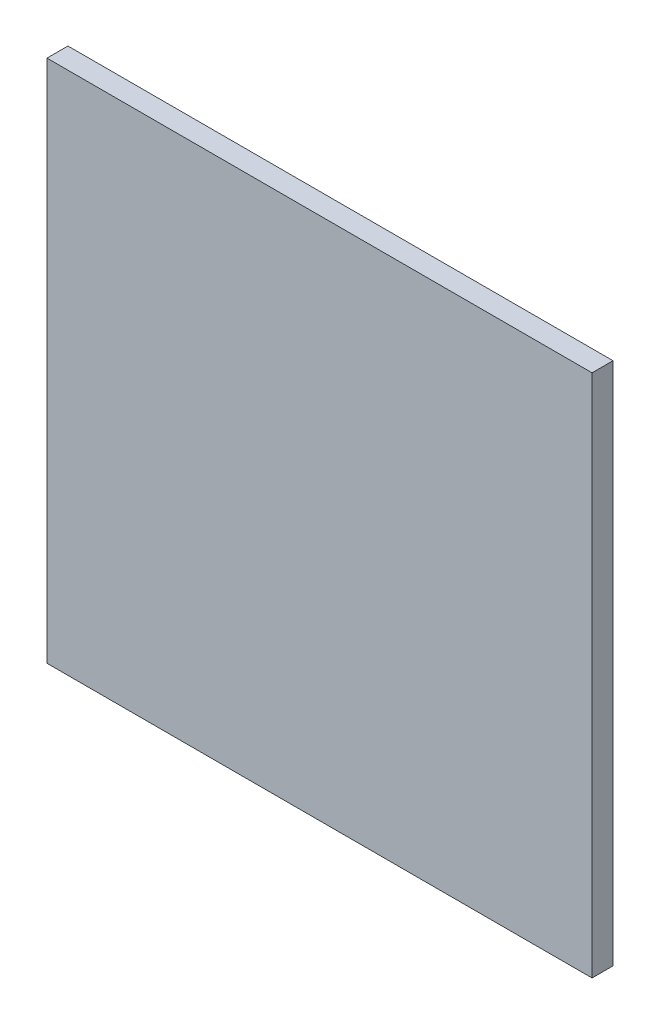
ISO-10303-21;
HEADER;
FILE_DESCRIPTION(('STEP AP214'),'2;1');
FILE_NAME('part.step','',(''),(''),'','','');
FILE_SCHEMA(('AUTOMOTIVE_DESIGN { 1 0 10303 214 1 1 1 1 }'));
ENDSEC;
DATA;
#1=APPLICATION_CONTEXT('core data for automotive mechanical design processes');
#2=APPLICATION_PROTOCOL_DEFINITION('international standard','automotive_design',2000,#1);
#3=PRODUCT_CONTEXT('',#1,'mechanical');
#4=PRODUCT('Part','Part','',(#3));
#5=PRODUCT_RELATED_PRODUCT_CATEGORY('part','',(#4));
#6=PRODUCT_DEFINITION_FORMATION('','',#4);
#7=PRODUCT_DEFINITION_CONTEXT('part definition',#1,'design');
#8=PRODUCT_DEFINITION('design','',#6,#7);
#9=PRODUCT_DEFINITION_SHAPE('','',#8);
#10=(LENGTH_UNIT() NAMED_UNIT(*) SI_UNIT(.MILLI.,.METRE.));
#11=(NAMED_UNIT(*) PLANE_ANGLE_UNIT() SI_UNIT($,.RADIAN.));
#12=(NAMED_UNIT(*) SI_UNIT($,.STERADIAN.) SOLID_ANGLE_UNIT());
#13=UNCERTAINTY_MEASURE_WITH_UNIT(LENGTH_MEASURE(1.E-05),#10,'distance_accuracy_value','');
#14=(GEOMETRIC_REPRESENTATION_CONTEXT(3) GLOBAL_UNCERTAINTY_ASSIGNED_CONTEXT((#13)) GLOBAL_UNIT_ASSIGNED_CONTEXT((#10,
#11,#12)) REPRESENTATION_CONTEXT('',''));
#15=CARTESIAN_POINT('',(0.,0.,0.));
#16=DIRECTION('',(0.,0.,1.));
#17=DIRECTION('',(1.,0.,0.));
#18=AXIS2_PLACEMENT_3D('',#15,#16,#17);
#19=CARTESIAN_POINT('',(1.6,2.55096118312577,0.5));
#20=DIRECTION('',(1.,0.,0.));
#21=DIRECTION('',(0.,0.,-1.));
#22=AXIS2_PLACEMENT_3D('',#19,#20,#21);
#23=PLANE('',#22);
#24=DIRECTION('',(0.,0.,-1.));
#25=VECTOR('',#24,1.);
#26=CARTESIAN_POINT('',(1.6,1.25,0.55));
#27=LINE('',#26,#25);
#28=CARTESIAN_POINT('',(1.6,1.25,0.55));
#29=VERTEX_POINT('',#28);
#30=CARTESIAN_POINT('',(1.6,1.25,0.5));
#31=VERTEX_POINT('',#30);
#32=EDGE_CURVE('E11',#29,#31,#27,.T.);
#33=ORIENTED_EDGE('',*,*,#32,.F.);
#34=DIRECTION('',(0.,-1.,0.));
#35=VECTOR('',#34,1.);
#36=CARTESIAN_POINT('',(1.6,1.25,0.55));
#37=LINE('',#36,#35);
#38=CARTESIAN_POINT('',(1.6,0.,0.55));
#39=VERTEX_POINT('',#38);
#40=EDGE_CURVE('E88',#29,#39,#37,.T.);
#41=ORIENTED_EDGE('',*,*,#40,.T.);
#42=DIRECTION('',(0.,0.,1.));
#43=VECTOR('',#42,1.);
#44=CARTESIAN_POINT('',(1.6,0.,0.5));
#45=LINE('',#44,#43);
#46=CARTESIAN_POINT('',(1.6,0.,0.5));
#47=VERTEX_POINT('',#46);
#48=EDGE_CURVE('E77',#47,#39,#45,.T.);
#49=ORIENTED_EDGE('',*,*,#48,.F.);
#50=DIRECTION('',(0.,-1.,0.));
#51=VECTOR('',#50,1.);
#52=CARTESIAN_POINT('',(1.6,1.25,0.5));
#53=LINE('',#52,#51);
#54=EDGE_CURVE('E84',#31,#47,#53,.T.);
#55=ORIENTED_EDGE('',*,*,#54,.F.);
#56=EDGE_LOOP('',(#33,#41,#49,#55));
#57=FACE_BOUND('',#56,.T.);
#58=ADVANCED_FACE('F17',(#57),#23,.T.);
#59=CARTESIAN_POINT('',(1.6,2.55096118312577,0.5));
#60=DIRECTION('',(0.,0.,-1.));
#61=DIRECTION('',(-1.,0.,0.));
#62=AXIS2_PLACEMENT_3D('',#59,#60,#61);
#63=PLANE('',#62);
#64=DIRECTION('',(-1.,0.,0.));
#65=VECTOR('',#64,1.);
#66=CARTESIAN_POINT('',(1.6,1.25,0.5));
#67=LINE('',#66,#65);
#68=CARTESIAN_POINT('',(0.3,1.25,0.5));
#69=VERTEX_POINT('',#68);
#70=EDGE_CURVE('E24',#31,#69,#67,.T.);
#71=ORIENTED_EDGE('',*,*,#70,.F.);
#72=ORIENTED_EDGE('',*,*,#54,.T.);
#73=DIRECTION('',(1.,0.,0.));
#74=VECTOR('',#73,1.);
#75=CARTESIAN_POINT('',(0.3,0.,0.5));
#76=LINE('',#75,#74);
#77=CARTESIAN_POINT('',(0.3,0.,0.5));
#78=VERTEX_POINT('',#77);
#79=EDGE_CURVE('E64',#78,#47,#76,.T.);
#80=ORIENTED_EDGE('',*,*,#79,.F.);
#81=DIRECTION('',(0.,-1.,0.));
#82=VECTOR('',#81,1.);
#83=CARTESIAN_POINT('',(0.3,1.25,0.5));
#84=LINE('',#83,#82);
#85=EDGE_CURVE('E69',#69,#78,#84,.T.);
#86=ORIENTED_EDGE('',*,*,#85,.F.);
#87=EDGE_LOOP('',(#71,#72,#80,#86));
#88=FACE_BOUND('',#87,.T.);
#89=ADVANCED_FACE('F91',(#88),#63,.T.);
#90=CARTESIAN_POINT('',(0.3,2.55096118312577,0.5));
#91=DIRECTION('',(-1.,0.,0.));
#92=DIRECTION('',(0.,0.,1.));
#93=AXIS2_PLACEMENT_3D('',#90,#91,#92);
#94=PLANE('',#93);
#95=DIRECTION('',(0.,0.,1.));
#96=VECTOR('',#95,1.);
#97=CARTESIAN_POINT('',(0.3,1.25,0.5));
#98=LINE('',#97,#96);
#99=CARTESIAN_POINT('',(0.3,1.25,0.55));
#100=VERTEX_POINT('',#99);
#101=EDGE_CURVE('E86',#69,#100,#98,.T.);
#102=ORIENTED_EDGE('',*,*,#101,.F.);
#103=ORIENTED_EDGE('',*,*,#85,.T.);
#104=DIRECTION('',(0.,0.,-1.));
#105=VECTOR('',#104,1.);
#106=CARTESIAN_POINT('',(0.3,0.,0.55));
#107=LINE('',#106,#105);
#108=CARTESIAN_POINT('',(0.3,0.,0.55));
#109=VERTEX_POINT('',#108);
#110=EDGE_CURVE('E65',#109,#78,#107,.T.);
#111=ORIENTED_EDGE('',*,*,#110,.F.);
#112=DIRECTION('',(0.,-1.,0.));
#113=VECTOR('',#112,1.);
#114=CARTESIAN_POINT('',(0.3,1.25,0.55));
#115=LINE('',#114,#113);
#116=EDGE_CURVE('E55',#100,#109,#115,.T.);
#117=ORIENTED_EDGE('',*,*,#116,.F.);
#118=EDGE_LOOP('',(#102,#103,#111,#117));
#119=FACE_BOUND('',#118,.T.);
#120=ADVANCED_FACE('F68',(#119),#94,.T.);
#121=CARTESIAN_POINT('',(1.6,2.55096118312577,0.55));
#122=DIRECTION('',(0.,0.,1.));
#123=DIRECTION('',(1.,0.,0.));
#124=AXIS2_PLACEMENT_3D('',#121,#122,#123);
#125=PLANE('',#124);
#126=DIRECTION('',(1.,0.,0.));
#127=VECTOR('',#126,1.);
#128=CARTESIAN_POINT('',(0.3,1.25,0.55));
#129=LINE('',#128,#127);
#130=EDGE_CURVE('E61',#100,#29,#129,.T.);
#131=ORIENTED_EDGE('',*,*,#130,.F.);
#132=ORIENTED_EDGE('',*,*,#116,.T.);
#133=DIRECTION('',(-1.,0.,0.));
#134=VECTOR('',#133,1.);
#135=CARTESIAN_POINT('',(1.6,0.,0.55));
#136=LINE('',#135,#134);
#137=EDGE_CURVE('E59',#39,#109,#136,.T.);
#138=ORIENTED_EDGE('',*,*,#137,.F.);
#139=ORIENTED_EDGE('',*,*,#40,.F.);
#140=EDGE_LOOP('',(#131,#132,#138,#139));
#141=FACE_BOUND('',#140,.T.);
#142=ADVANCED_FACE('F57',(#141),#125,.T.);
#143=CARTESIAN_POINT('',(0.,0.,0.));
#144=DIRECTION('',(0.,-1.,0.));
#145=DIRECTION('',(0.,0.,-1.));
#146=AXIS2_PLACEMENT_3D('',#143,#144,#145);
#147=PLANE('',#146);
#148=ORIENTED_EDGE('',*,*,#48,.T.);
#149=ORIENTED_EDGE('',*,*,#137,.T.);
#150=ORIENTED_EDGE('',*,*,#110,.T.);
#151=ORIENTED_EDGE('',*,*,#79,.T.);
#152=EDGE_LOOP('',(#148,#149,#150,#151));
#153=FACE_BOUND('',#152,.T.);
#154=ADVANCED_FACE('F75',(#153),#147,.T.);
#155=CARTESIAN_POINT('',(0.,1.25,0.5));
#156=DIRECTION('',(0.,-1.,0.));
#157=DIRECTION('',(0.,0.,-1.));
#158=AXIS2_PLACEMENT_3D('',#155,#156,#157);
#159=PLANE('',#158);
#160=ORIENTED_EDGE('',*,*,#32,.T.);
#161=ORIENTED_EDGE('',*,*,#70,.T.);
#162=ORIENTED_EDGE('',*,*,#101,.T.);
#163=ORIENTED_EDGE('',*,*,#130,.T.);
#164=EDGE_LOOP('',(#160,#161,#162,#163));
#165=FACE_BOUND('',#164,.T.);
#166=ADVANCED_FACE('F90',(#165),#159,.F.);
#167=CLOSED_SHELL('',(#58,#89,#120,#142,#154,#166));
#168=MANIFOLD_SOLID_BREP('B1',#167);
#169=ADVANCED_BREP_SHAPE_REPRESENTATION('',(#18,#168),#14);
#170=SHAPE_DEFINITION_REPRESENTATION(#9,#169);
ENDSEC;
END-ISO-10303-21;
